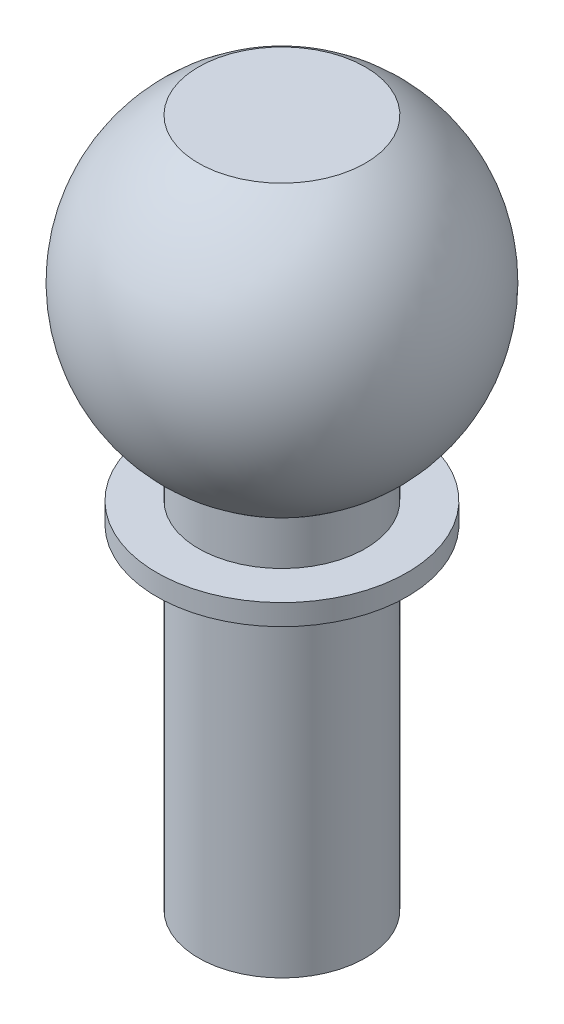
ISO-10303-21;
HEADER;
FILE_DESCRIPTION(('STEP AP214'),'2;1');
FILE_NAME('part.step','',(''),(''),'','','');
FILE_SCHEMA(('AUTOMOTIVE_DESIGN { 1 0 10303 214 1 1 1 1 }'));
ENDSEC;
DATA;
#1=APPLICATION_CONTEXT('core data for automotive mechanical design processes');
#2=APPLICATION_PROTOCOL_DEFINITION('international standard','automotive_design',2000,#1);
#3=PRODUCT_CONTEXT('',#1,'mechanical');
#4=PRODUCT('Part','Part','',(#3));
#5=PRODUCT_RELATED_PRODUCT_CATEGORY('part','',(#4));
#6=PRODUCT_DEFINITION_FORMATION('','',#4);
#7=PRODUCT_DEFINITION_CONTEXT('part definition',#1,'design');
#8=PRODUCT_DEFINITION('design','',#6,#7);
#9=PRODUCT_DEFINITION_SHAPE('','',#8);
#10=(LENGTH_UNIT() NAMED_UNIT(*) SI_UNIT(.MILLI.,.METRE.));
#11=(NAMED_UNIT(*) PLANE_ANGLE_UNIT() SI_UNIT($,.RADIAN.));
#12=(NAMED_UNIT(*) SI_UNIT($,.STERADIAN.) SOLID_ANGLE_UNIT());
#13=UNCERTAINTY_MEASURE_WITH_UNIT(LENGTH_MEASURE(1.E-05),#10,'distance_accuracy_value','');
#14=(GEOMETRIC_REPRESENTATION_CONTEXT(3) GLOBAL_UNCERTAINTY_ASSIGNED_CONTEXT((#13)) GLOBAL_UNIT_ASSIGNED_CONTEXT((#10,
#11,#12)) REPRESENTATION_CONTEXT('',''));
#15=CARTESIAN_POINT('',(0.,0.,0.));
#16=DIRECTION('',(0.,0.,1.));
#17=DIRECTION('',(1.,0.,0.));
#18=AXIS2_PLACEMENT_3D('',#15,#16,#17);
#19=CARTESIAN_POINT('',(0.,0.,0.));
#20=DIRECTION('',(0.,-1.,0.));
#21=DIRECTION('',(0.,0.,-1.));
#22=AXIS2_PLACEMENT_3D('',#19,#20,#21);
#23=PLANE('',#22);
#24=CARTESIAN_POINT('',(0.,0.,0.));
#25=DIRECTION('',(0.,-1.,0.));
#26=DIRECTION('',(0.,0.,-1.));
#27=AXIS2_PLACEMENT_3D('',#24,#25,#26);
#28=CIRCLE('',#27,20.);
#29=CARTESIAN_POINT('',(0.,0.,-20.));
#30=VERTEX_POINT('',#29);
#31=EDGE_CURVE('E10',#30,#30,#28,.T.);
#32=ORIENTED_EDGE('',*,*,#31,.T.);
#33=EDGE_LOOP('',(#32));
#34=FACE_BOUND('',#33,.T.);
#35=ADVANCED_FACE('F33',(#34),#23,.T.);
#36=CARTESIAN_POINT('',(0.,0.,0.));
#37=DIRECTION('',(0.,-1.,0.));
#38=DIRECTION('',(0.,0.,-1.));
#39=AXIS2_PLACEMENT_3D('',#36,#37,#38);
#40=CYLINDRICAL_SURFACE('',#39,20.);
#41=CARTESIAN_POINT('',(0.,80.,0.));
#42=DIRECTION('',(0.,-1.,0.));
#43=DIRECTION('',(0.,0.,-1.));
#44=AXIS2_PLACEMENT_3D('',#41,#42,#43);
#45=CIRCLE('',#44,20.);
#46=CARTESIAN_POINT('',(0.,80.,-20.));
#47=VERTEX_POINT('',#46);
#48=EDGE_CURVE('E39',#47,#47,#45,.T.);
#49=ORIENTED_EDGE('',*,*,#48,.T.);
#50=EDGE_LOOP('',(#49));
#51=FACE_BOUND('',#50,.T.);
#52=ORIENTED_EDGE('',*,*,#31,.F.);
#53=EDGE_LOOP('',(#52));
#54=FACE_BOUND('',#53,.T.);
#55=ADVANCED_FACE('F74',(#51,#54),#40,.T.);
#56=CARTESIAN_POINT('',(20.,80.,0.));
#57=DIRECTION('',(0.,-1.,0.));
#58=DIRECTION('',(0.,0.,-1.));
#59=AXIS2_PLACEMENT_3D('',#56,#57,#58);
#60=PLANE('',#59);
#61=CARTESIAN_POINT('',(0.,80.,0.));
#62=DIRECTION('',(0.,-1.,0.));
#63=DIRECTION('',(0.,0.,-1.));
#64=AXIS2_PLACEMENT_3D('',#61,#62,#63);
#65=CIRCLE('',#64,30.);
#66=CARTESIAN_POINT('',(0.,80.,-30.));
#67=VERTEX_POINT('',#66);
#68=EDGE_CURVE('E43',#67,#67,#65,.T.);
#69=ORIENTED_EDGE('',*,*,#68,.T.);
#70=EDGE_LOOP('',(#69));
#71=FACE_BOUND('',#70,.T.);
#72=ORIENTED_EDGE('',*,*,#48,.F.);
#73=EDGE_LOOP('',(#72));
#74=FACE_BOUND('',#73,.T.);
#75=ADVANCED_FACE('F78',(#71,#74),#60,.T.);
#76=CARTESIAN_POINT('',(0.,0.,0.));
#77=DIRECTION('',(0.,-1.,0.));
#78=DIRECTION('',(0.,0.,-1.));
#79=AXIS2_PLACEMENT_3D('',#76,#77,#78);
#80=CYLINDRICAL_SURFACE('',#79,30.);
#81=CARTESIAN_POINT('',(0.,85.,0.));
#82=DIRECTION('',(0.,-1.,0.));
#83=DIRECTION('',(0.,0.,-1.));
#84=AXIS2_PLACEMENT_3D('',#81,#82,#83);
#85=CIRCLE('',#84,30.);
#86=CARTESIAN_POINT('',(0.,85.,-30.));
#87=VERTEX_POINT('',#86);
#88=EDGE_CURVE('E47',#87,#87,#85,.T.);
#89=ORIENTED_EDGE('',*,*,#88,.T.);
#90=EDGE_LOOP('',(#89));
#91=FACE_BOUND('',#90,.T.);
#92=ORIENTED_EDGE('',*,*,#68,.F.);
#93=EDGE_LOOP('',(#92));
#94=FACE_BOUND('',#93,.T.);
#95=ADVANCED_FACE('F82',(#91,#94),#80,.T.);
#96=CARTESIAN_POINT('',(30.,85.,0.));
#97=DIRECTION('',(0.,1.,0.));
#98=DIRECTION('',(0.,0.,1.));
#99=AXIS2_PLACEMENT_3D('',#96,#97,#98);
#100=PLANE('',#99);
#101=CARTESIAN_POINT('',(0.,85.,0.));
#102=DIRECTION('',(0.,-1.,0.));
#103=DIRECTION('',(0.,0.,-1.));
#104=AXIS2_PLACEMENT_3D('',#101,#102,#103);
#105=CIRCLE('',#104,20.);
#106=CARTESIAN_POINT('',(0.,85.,-20.));
#107=VERTEX_POINT('',#106);
#108=EDGE_CURVE('E52',#107,#107,#105,.T.);
#109=ORIENTED_EDGE('',*,*,#108,.T.);
#110=EDGE_LOOP('',(#109));
#111=FACE_BOUND('',#110,.T.);
#112=ORIENTED_EDGE('',*,*,#88,.F.);
#113=EDGE_LOOP('',(#112));
#114=FACE_BOUND('',#113,.T.);
#115=ADVANCED_FACE('F89',(#111,#114),#100,.T.);
#116=CARTESIAN_POINT('',(0.,0.,0.));
#117=DIRECTION('',(0.,-1.,0.));
#118=DIRECTION('',(0.,0.,-1.));
#119=AXIS2_PLACEMENT_3D('',#116,#117,#118);
#120=CYLINDRICAL_SURFACE('',#119,20.);
#121=CARTESIAN_POINT('',(0.,95.7179676972449,0.));
#122=DIRECTION('',(0.,-1.,0.));
#123=DIRECTION('',(0.,0.,-1.));
#124=AXIS2_PLACEMENT_3D('',#121,#122,#123);
#125=CIRCLE('',#124,20.);
#126=CARTESIAN_POINT('',(0.,95.7179676972449,-20.));
#127=VERTEX_POINT('',#126);
#128=EDGE_CURVE('E55',#127,#127,#125,.T.);
#129=ORIENTED_EDGE('',*,*,#128,.T.);
#130=EDGE_LOOP('',(#129));
#131=FACE_BOUND('',#130,.T.);
#132=ORIENTED_EDGE('',*,*,#108,.F.);
#133=EDGE_LOOP('',(#132));
#134=FACE_BOUND('',#133,.T.);
#135=ADVANCED_FACE('F71',(#131,#134),#120,.T.);
#136=CARTESIAN_POINT('',(0.,130.358983848622,0.));
#137=DIRECTION('',(0.,-1.,0.));
#138=DIRECTION('',(1.,0.,0.));
#139=AXIS2_PLACEMENT_3D('',#136,#137,#138);
#140=SPHERICAL_SURFACE('',#139,40.);
#141=CARTESIAN_POINT('',(0.,165.,0.));
#142=DIRECTION('',(0.,-1.,0.));
#143=DIRECTION('',(0.,0.,-1.));
#144=AXIS2_PLACEMENT_3D('',#141,#142,#143);
#145=CIRCLE('',#144,20.);
#146=CARTESIAN_POINT('',(0.,165.,-20.));
#147=VERTEX_POINT('',#146);
#148=EDGE_CURVE('E58',#147,#147,#145,.T.);
#149=ORIENTED_EDGE('',*,*,#148,.T.);
#150=EDGE_LOOP('',(#149));
#151=FACE_BOUND('',#150,.T.);
#152=ORIENTED_EDGE('',*,*,#128,.F.);
#153=EDGE_LOOP('',(#152));
#154=FACE_BOUND('',#153,.T.);
#155=ADVANCED_FACE('F62',(#151,#154),#140,.T.);
#156=CARTESIAN_POINT('',(0.,165.,0.));
#157=DIRECTION('',(0.,1.,0.));
#158=DIRECTION('',(0.,0.,1.));
#159=AXIS2_PLACEMENT_3D('',#156,#157,#158);
#160=PLANE('',#159);
#161=ORIENTED_EDGE('',*,*,#148,.F.);
#162=EDGE_LOOP('',(#161));
#163=FACE_BOUND('',#162,.T.);
#164=ADVANCED_FACE('F65',(#163),#160,.T.);
#165=CLOSED_SHELL('',(#35,#55,#75,#95,#115,#135,#155,#164));
#166=MANIFOLD_SOLID_BREP('B2',#165);
#167=ADVANCED_BREP_SHAPE_REPRESENTATION('',(#18,#166),#14);
#168=SHAPE_DEFINITION_REPRESENTATION(#9,#167);
ENDSEC;
END-ISO-10303-21;
